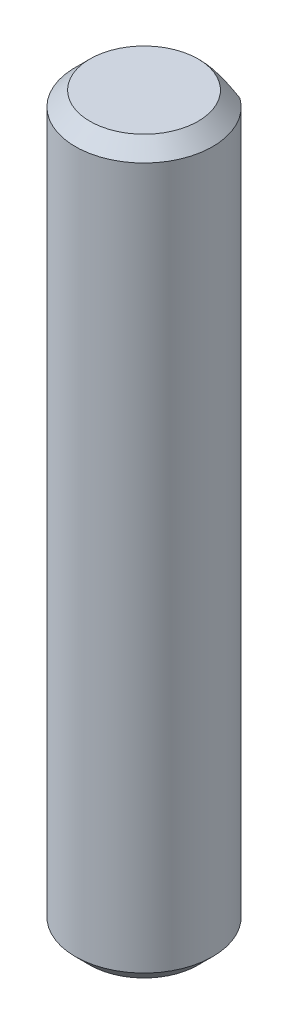
ISO-10303-21;
HEADER;
FILE_DESCRIPTION(('STEP AP214'),'2;1');
FILE_NAME('part.step','',(''),(''),'','','');
FILE_SCHEMA(('AUTOMOTIVE_DESIGN { 1 0 10303 214 1 1 1 1 }'));
ENDSEC;
DATA;
#1=APPLICATION_CONTEXT('core data for automotive mechanical design processes');
#2=APPLICATION_PROTOCOL_DEFINITION('international standard','automotive_design',2000,#1);
#3=PRODUCT_CONTEXT('',#1,'mechanical');
#4=PRODUCT('Part','Part','',(#3));
#5=PRODUCT_RELATED_PRODUCT_CATEGORY('part','',(#4));
#6=PRODUCT_DEFINITION_FORMATION('','',#4);
#7=PRODUCT_DEFINITION_CONTEXT('part definition',#1,'design');
#8=PRODUCT_DEFINITION('design','',#6,#7);
#9=PRODUCT_DEFINITION_SHAPE('','',#8);
#10=(LENGTH_UNIT() NAMED_UNIT(*) SI_UNIT(.MILLI.,.METRE.));
#11=(NAMED_UNIT(*) PLANE_ANGLE_UNIT() SI_UNIT($,.RADIAN.));
#12=(NAMED_UNIT(*) SI_UNIT($,.STERADIAN.) SOLID_ANGLE_UNIT());
#13=UNCERTAINTY_MEASURE_WITH_UNIT(LENGTH_MEASURE(1.E-05),#10,'distance_accuracy_value','');
#14=(GEOMETRIC_REPRESENTATION_CONTEXT(3) GLOBAL_UNCERTAINTY_ASSIGNED_CONTEXT((#13)) GLOBAL_UNIT_ASSIGNED_CONTEXT((#10,
#11,#12)) REPRESENTATION_CONTEXT('',''));
#15=CARTESIAN_POINT('',(0.,0.,0.));
#16=DIRECTION('',(0.,0.,1.));
#17=DIRECTION('',(1.,0.,0.));
#18=AXIS2_PLACEMENT_3D('',#15,#16,#17);
#19=CARTESIAN_POINT('',(-1.84999999999999,12.5,0.));
#20=DIRECTION('',(0.,1.,0.));
#21=DIRECTION('',(0.,0.,1.));
#22=AXIS2_PLACEMENT_3D('',#19,#20,#21);
#23=PLANE('',#22);
#24=CARTESIAN_POINT('',(0.,12.4999999999886,0.));
#25=DIRECTION('',(0.,-1.,0.));
#26=DIRECTION('',(0.,0.,-1.));
#27=AXIS2_PLACEMENT_3D('',#24,#25,#26);
#28=CIRCLE('',#27,1.84999999999036);
#29=CARTESIAN_POINT('',(0.,12.4999999999886,-1.84999999999036));
#30=VERTEX_POINT('',#29);
#31=EDGE_CURVE('E18',#30,#30,#28,.T.);
#32=ORIENTED_EDGE('',*,*,#31,.F.);
#33=EDGE_LOOP('',(#32));
#34=FACE_BOUND('',#33,.T.);
#35=ADVANCED_FACE('F15',(#34),#23,.T.);
#36=CARTESIAN_POINT('',(0.,-12.5,0.));
#37=DIRECTION('',(0.,-1.,0.));
#38=DIRECTION('',(0.,0.,-1.));
#39=AXIS2_PLACEMENT_3D('',#36,#37,#38);
#40=PLANE('',#39);
#41=CARTESIAN_POINT('',(0.,-12.5000000000455,0.));
#42=DIRECTION('',(0.,1.,0.));
#43=DIRECTION('',(0.,0.,1.));
#44=AXIS2_PLACEMENT_3D('',#41,#42,#43);
#45=CIRCLE('',#44,1.84999999999036);
#46=CARTESIAN_POINT('',(0.,-12.5000000000455,1.84999999999036));
#47=VERTEX_POINT('',#46);
#48=EDGE_CURVE('E48',#47,#47,#45,.T.);
#49=ORIENTED_EDGE('',*,*,#48,.F.);
#50=EDGE_LOOP('',(#49));
#51=FACE_BOUND('',#50,.T.);
#52=ADVANCED_FACE('F81',(#51),#40,.T.);
#53=CARTESIAN_POINT('',(0.,12.0000000000573,0.));
#54=DIRECTION('',(0.,-1.,0.));
#55=DIRECTION('',(0.,0.,-1.));
#56=AXIS2_PLACEMENT_3D('',#53,#54,#55);
#57=CONICAL_SURFACE('',#56,2.34999999992169,0.785398163397448);
#58=ORIENTED_EDGE('',*,*,#31,.T.);
#59=EDGE_LOOP('',(#58));
#60=FACE_BOUND('',#59,.T.);
#61=CARTESIAN_POINT('',(1.38293294137253,11.9999988564426,-1.89999934864234));
#62=CARTESIAN_POINT('',(1.31640504016734,12.0391091906286,-1.89999976652599));
#63=CARTESIAN_POINT('',(1.24906092665392,12.0769313351354,-1.89999993752832));
#64=CARTESIAN_POINT('',(1.11226480469869,12.1491599942803,-1.90000006269622));
#65=CARTESIAN_POINT('',(1.04280609063244,12.1835537452313,-1.90000001608032));
#66=CARTESIAN_POINT('',(0.90069026973495,12.2482876803671,-1.89999998367116));
#67=CARTESIAN_POINT('',(0.828000321124784,12.2785569950614,-1.89999999882912));
#68=CARTESIAN_POINT('',(0.680460864910129,12.3329891238734,-1.90000000116914));
#69=CARTESIAN_POINT('',(0.605614771562803,12.3571610583892,-1.89999998839326));
#70=CARTESIAN_POINT('',(0.443136132283128,12.4007865134194,-1.9000000132399));
#71=CARTESIAN_POINT('',(0.355186263179777,12.4190975768688,-1.90000005820665));
#72=CARTESIAN_POINT('',(0.178141004999519,12.4436589937949,-1.8999999421835));
#73=CARTESIAN_POINT('',(0.0890572446786742,12.4499893610337,-1.89999978257198));
#74=CARTESIAN_POINT('',(-0.0575881142429245,12.4500067607594,-1.89999984894757));
#75=CARTESIAN_POINT('',(-0.115171246035014,12.4473694112012,-1.8999999586626));
#76=CARTESIAN_POINT('',(-0.229881251031926,12.4369967980032,-1.90000004134718));
#77=CARTESIAN_POINT('',(-0.287008013351038,12.4292603313864,-1.90000001428444));
#78=CARTESIAN_POINT('',(-0.458031008451664,12.3988010989319,-1.89999997121219));
#79=CARTESIAN_POINT('',(-0.570675354229978,12.3688377779865,-1.8999999943241));
#80=CARTESIAN_POINT('',(-0.742716769310871,12.3108374802104,-1.90000000319809));
#81=CARTESIAN_POINT('',(-0.803891470486844,12.2876699354948,-1.90000000086072));
#82=CARTESIAN_POINT('',(-0.924748666311584,12.2376208851179,-1.8999999991389));
#83=CARTESIAN_POINT('',(-0.984430447604094,12.2107376425731,-1.89999999975583));
#84=CARTESIAN_POINT('',(-1.10132754135084,12.1544744773383,-1.90000000024002));
#85=CARTESIAN_POINT('',(-1.15856758366832,12.1251451473882,-1.90000000011992));
#86=CARTESIAN_POINT('',(-1.2716968899862,12.0641802556259,-1.89999999988029));
#87=CARTESIAN_POINT('',(-1.32758809252038,12.0325483029034,-1.89999999976075));
#88=CARTESIAN_POINT('',(-1.38292113903435,12.0000061964152,-1.90000000000001));
#89=B_SPLINE_CURVE_WITH_KNOTS('',3,(#61,#62,#63,#64,#65,#66,#67,#68,#69,#70,#71,#72,#73,#74,#75,
#76,#77,#78,#79,#80,#81,#82,#83,#84,#85,#86,#87,#88),.UNSPECIFIED.,.F.,.F.,(4,2,2,2,2,2,2,2,2,2,
2,2,2,4),(0.,0.231578295021657,0.463988842923427,0.699991587764611,0.935639200439021,
1.20444359311888,1.47144633685215,1.64415328643467,1.81690099540549,2.16504445870239,
2.36120459004528,2.55745672749609,2.75035073717181,2.94294866119235),.UNSPECIFIED.);
#90=CARTESIAN_POINT('',(1.38293239120927,11.9999995747435,-1.90000000000001));
#91=VERTEX_POINT('',#90);
#92=CARTESIAN_POINT('',(-1.38292895542507,12.0000194787188,-1.89999627239662));
#93=VERTEX_POINT('',#92);
#94=EDGE_CURVE('E42',#91,#93,#89,.T.);
#95=ORIENTED_EDGE('',*,*,#94,.T.);
#96=CARTESIAN_POINT('',(0.,12.,0.));
#97=DIRECTION('',(0.,1.,0.));
#98=DIRECTION('',(0.,0.,1.));
#99=AXIS2_PLACEMENT_3D('',#96,#97,#98);
#100=CIRCLE('',#99,2.34999999999999);
#101=EDGE_CURVE('E50',#91,#93,#100,.F.);
#102=ORIENTED_EDGE('',*,*,#101,.F.);
#103=EDGE_LOOP('',(#95,#102));
#104=FACE_BOUND('',#103,.T.);
#105=ADVANCED_FACE('F51',(#60,#104),#57,.T.);
#106=CARTESIAN_POINT('',(0.,-12.0000000000573,0.));
#107=DIRECTION('',(0.,1.,0.));
#108=DIRECTION('',(0.,0.,1.));
#109=AXIS2_PLACEMENT_3D('',#106,#107,#108);
#110=CONICAL_SURFACE('',#109,2.34999999997854,0.785398163397448);
#111=ORIENTED_EDGE('',*,*,#48,.T.);
#112=EDGE_LOOP('',(#111));
#113=FACE_BOUND('',#112,.T.);
#114=CARTESIAN_POINT('',(-1.3829211362448,-12.0000061981137,-1.90000000000001));
#115=CARTESIAN_POINT('',(-1.31639376728427,-12.0391157462203,-1.90000000000001));
#116=CARTESIAN_POINT('',(-1.24905025865164,-12.0769372241723,-1.90000000000001));
#117=CARTESIAN_POINT('',(-1.11225543649762,-12.149164680286,-1.90000000000001));
#118=CARTESIAN_POINT('',(-1.04279741773434,-12.1835578953884,-1.90000000000001));
#119=CARTESIAN_POINT('',(-0.900683009588374,-12.2482907855211,-1.90000000000001));
#120=CARTESIAN_POINT('',(-0.827993778402118,-12.2785595906241,-1.90000000000001));
#121=CARTESIAN_POINT('',(-0.680455811018663,-12.3329908070564,-1.90000000000001));
#122=CARTESIAN_POINT('',(-0.605610488932441,-12.357162338464,-1.90000000000001));
#123=CARTESIAN_POINT('',(-0.443129792249884,-12.4007880677348,-1.90000000000001));
#124=CARTESIAN_POINT('',(-0.355176982023888,-12.4190993987095,-1.90000000000001));
#125=CARTESIAN_POINT('',(-0.17812583900251,-12.4436605696883,-1.90000000000001));
#126=CARTESIAN_POINT('',(-0.089039135799881,-12.4499904321702,-1.90000000000001));
#127=CARTESIAN_POINT('',(0.0576095739204949,-12.4500061886799,-1.90000000000001));
#128=CARTESIAN_POINT('',(0.115193159112163,-12.4473681130604,-1.90000000000001));
#129=CARTESIAN_POINT('',(0.229904011584844,-12.4369940561025,-1.90000000000001));
#130=CARTESIAN_POINT('',(0.287031167945438,-12.4292568715712,-1.90000000000001));
#131=CARTESIAN_POINT('',(0.458055280962878,-12.3987954432998,-1.90000000000001));
#132=CARTESIAN_POINT('',(0.570700259452116,-12.3688306131501,-1.90000000000001));
#133=CARTESIAN_POINT('',(0.742741005564309,-12.3108286095573,-1.90000000000001));
#134=CARTESIAN_POINT('',(0.803914486962622,-12.2876609277884,-1.90000000000001));
#135=CARTESIAN_POINT('',(0.924769297698898,-12.2376118192872,-1.90000000000001));
#136=CARTESIAN_POINT('',(0.984449913792853,-12.2107286559787,-1.90000000000001));
#137=CARTESIAN_POINT('',(1.101344741747,-12.1544658211709,-1.90000000000001));
#138=CARTESIAN_POINT('',(1.15858368282885,-12.1251367404347,-1.90000000000001));
#139=CARTESIAN_POINT('',(1.27171085169751,-12.0641724664021,-1.90000000000001));
#140=CARTESIAN_POINT('',(1.32760101775435,-12.0325408816722,-1.90000000000001));
#141=CARTESIAN_POINT('',(1.38293305243174,-11.9999991856725,-1.90000000000001));
#142=B_SPLINE_CURVE_WITH_KNOTS('',3,(#114,#115,#116,#117,#118,#119,#120,#121,#122,#123,#124,
#125,#126,#127,#128,#129,#130,#131,#132,#133,#134,#135,#136,#137,#138,#139,#140,#141),
.UNSPECIFIED.,.F.,.F.,(4,2,2,2,2,2,2,2,2,2,2,2,2,4),(0.,0.231575736059569,0.463983706280565,
0.699983878002507,0.935628927713979,1.20444205220658,1.47145338976331,1.64416179340919,
1.81691096417448,2.16505743132646,2.36121429983492,2.55746316197927,2.75035389558879,
2.94294857591165),.UNSPECIFIED.);
#143=CARTESIAN_POINT('',(-1.38292895470482,-12.0000194839335,-1.89999627140708));
#144=VERTEX_POINT('',#143);
#145=CARTESIAN_POINT('',(1.3829323912235,-11.9999995747636,-1.90000000000001));
#146=VERTEX_POINT('',#145);
#147=EDGE_CURVE('E30',#144,#146,#142,.T.);
#148=ORIENTED_EDGE('',*,*,#147,.T.);
#149=CARTESIAN_POINT('',(0.,-12.,0.));
#150=DIRECTION('',(0.,1.,0.));
#151=DIRECTION('',(0.,0.,1.));
#152=AXIS2_PLACEMENT_3D('',#149,#150,#151);
#153=CIRCLE('',#152,2.34999999999999);
#154=EDGE_CURVE('E23',#144,#146,#153,.T.);
#155=ORIENTED_EDGE('',*,*,#154,.F.);
#156=EDGE_LOOP('',(#148,#155));
#157=FACE_BOUND('',#156,.T.);
#158=ADVANCED_FACE('F74',(#113,#157),#110,.T.);
#159=CARTESIAN_POINT('',(0.,-12.5,-1.90000000000001));
#160=DIRECTION('',(0.,0.,1.));
#161=DIRECTION('',(1.,0.,0.));
#162=AXIS2_PLACEMENT_3D('',#159,#160,#161);
#163=PLANE('',#162);
#164=DIRECTION('',(0.,1.,0.));
#165=VECTOR('',#164,1.);
#166=CARTESIAN_POINT('',(-1.3829316685939,12.5,-1.90000000000001));
#167=LINE('',#166,#165);
#168=EDGE_CURVE('E46',#93,#144,#167,.F.);
#169=ORIENTED_EDGE('',*,*,#168,.F.);
#170=ORIENTED_EDGE('',*,*,#94,.F.);
#171=DIRECTION('',(0.,1.,0.));
#172=VECTOR('',#171,1.);
#173=CARTESIAN_POINT('',(1.38293166859389,12.5,-1.90000000000001));
#174=LINE('',#173,#172);
#175=EDGE_CURVE('E10',#146,#91,#174,.T.);
#176=ORIENTED_EDGE('',*,*,#175,.F.);
#177=ORIENTED_EDGE('',*,*,#147,.F.);
#178=EDGE_LOOP('',(#169,#170,#176,#177));
#179=FACE_BOUND('',#178,.T.);
#180=ADVANCED_FACE('F44',(#179),#163,.F.);
#181=CARTESIAN_POINT('',(0.,12.5,0.));
#182=DIRECTION('',(0.,1.,0.));
#183=DIRECTION('',(0.,0.,1.));
#184=AXIS2_PLACEMENT_3D('',#181,#182,#183);
#185=CYLINDRICAL_SURFACE('',#184,2.34999999999999);
#186=ORIENTED_EDGE('',*,*,#154,.T.);
#187=ORIENTED_EDGE('',*,*,#175,.T.);
#188=ORIENTED_EDGE('',*,*,#101,.T.);
#189=ORIENTED_EDGE('',*,*,#168,.T.);
#190=EDGE_LOOP('',(#186,#187,#188,#189));
#191=FACE_BOUND('',#190,.T.);
#192=ADVANCED_FACE('F54',(#191),#185,.T.);
#193=CLOSED_SHELL('',(#35,#52,#105,#158,#180,#192));
#194=MANIFOLD_SOLID_BREP('B1',#193);
#195=ADVANCED_BREP_SHAPE_REPRESENTATION('',(#18,#194),#14);
#196=SHAPE_DEFINITION_REPRESENTATION(#9,#195);
ENDSEC;
END-ISO-10303-21;
